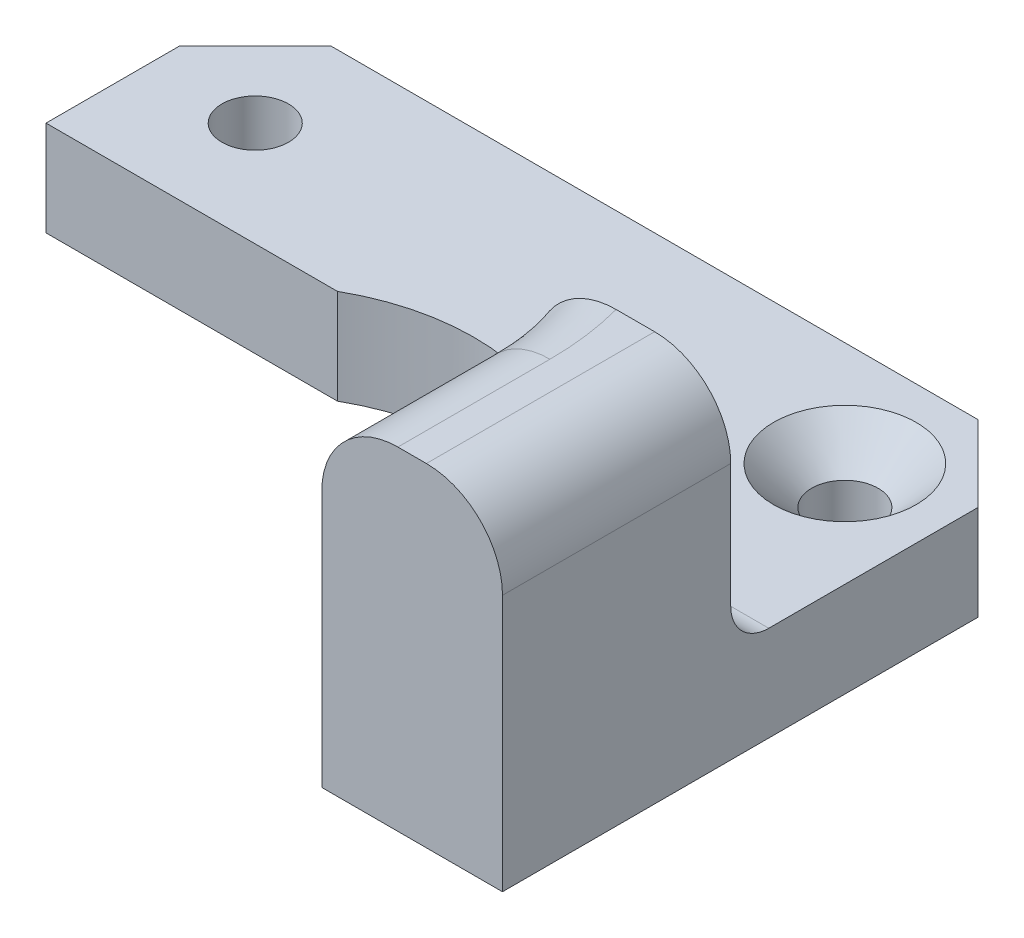
ISO-10303-21;
HEADER;
FILE_DESCRIPTION(('STEP AP214'),'2;1');
FILE_NAME('part.step','',(''),(''),'','','');
FILE_SCHEMA(('AUTOMOTIVE_DESIGN { 1 0 10303 214 1 1 1 1 }'));
ENDSEC;
DATA;
#1=APPLICATION_CONTEXT('core data for automotive mechanical design processes');
#2=APPLICATION_PROTOCOL_DEFINITION('international standard','automotive_design',2000,#1);
#3=PRODUCT_CONTEXT('',#1,'mechanical');
#4=PRODUCT('Part','Part','',(#3));
#5=PRODUCT_RELATED_PRODUCT_CATEGORY('part','',(#4));
#6=PRODUCT_DEFINITION_FORMATION('','',#4);
#7=PRODUCT_DEFINITION_CONTEXT('part definition',#1,'design');
#8=PRODUCT_DEFINITION('design','',#6,#7);
#9=PRODUCT_DEFINITION_SHAPE('','',#8);
#10=(LENGTH_UNIT() NAMED_UNIT(*) SI_UNIT(.MILLI.,.METRE.));
#11=(NAMED_UNIT(*) PLANE_ANGLE_UNIT() SI_UNIT($,.RADIAN.));
#12=(NAMED_UNIT(*) SI_UNIT($,.STERADIAN.) SOLID_ANGLE_UNIT());
#13=UNCERTAINTY_MEASURE_WITH_UNIT(LENGTH_MEASURE(1.E-05),#10,'distance_accuracy_value','');
#14=(GEOMETRIC_REPRESENTATION_CONTEXT(3) GLOBAL_UNCERTAINTY_ASSIGNED_CONTEXT((#13)) GLOBAL_UNIT_ASSIGNED_CONTEXT((#10,
#11,#12)) REPRESENTATION_CONTEXT('',''));
#15=CARTESIAN_POINT('',(0.,0.,0.));
#16=DIRECTION('',(0.,0.,1.));
#17=DIRECTION('',(1.,0.,0.));
#18=AXIS2_PLACEMENT_3D('',#15,#16,#17);
#19=CARTESIAN_POINT('',(10.7819293264239,17.5,-4.));
#20=DIRECTION('',(0.,0.,-1.));
#21=DIRECTION('',(-1.,0.,0.));
#22=AXIS2_PLACEMENT_3D('',#19,#20,#21);
#23=PLANE('',#22);
#24=CARTESIAN_POINT('',(16.25,12.,-4.));
#25=DIRECTION('',(0.,0.,-1.));
#26=DIRECTION('',(-1.,0.,0.));
#27=AXIS2_PLACEMENT_3D('',#24,#25,#26);
#28=CIRCLE('',#27,3.20020753820971);
#29=CARTESIAN_POINT('',(13.0497924617903,12.,-4.));
#30=VERTEX_POINT('',#29);
#31=EDGE_CURVE('E182',#30,#30,#28,.F.);
#32=ORIENTED_EDGE('',*,*,#31,.T.);
#33=EDGE_LOOP('',(#32));
#34=FACE_BOUND('',#33,.T.);
#35=DIRECTION('',(0.,-1.,0.));
#36=VECTOR('',#35,1.);
#37=CARTESIAN_POINT('',(10.7819293264239,17.5,-4.));
#38=LINE('',#37,#36);
#39=CARTESIAN_POINT('',(10.7819293264239,13.5,-4.));
#40=VERTEX_POINT('',#39);
#41=CARTESIAN_POINT('',(10.7819293264239,7.,-4.));
#42=VERTEX_POINT('',#41);
#43=EDGE_CURVE('E316',#40,#42,#38,.T.);
#44=ORIENTED_EDGE('',*,*,#43,.F.);
#45=CARTESIAN_POINT('',(10.7819293264239,13.5,-4.));
#46=CARTESIAN_POINT('',(10.7819113322001,13.6079339404412,-4.));
#47=CARTESIAN_POINT('',(10.7865881810567,13.7158624061115,-4.));
#48=CARTESIAN_POINT('',(10.8051986474926,13.9308957444516,-4.));
#49=CARTESIAN_POINT('',(10.8191302710947,14.0380007895032,-4.));
#50=CARTESIAN_POINT('',(10.8560670519765,14.250331960623,-4.));
#51=CARTESIAN_POINT('',(10.8790473665792,14.3555624133835,-4.));
#52=CARTESIAN_POINT('',(10.9338331924457,14.5636984620619,-4.));
#53=CARTESIAN_POINT('',(10.9656388991992,14.6666040064267,-4.));
#54=CARTESIAN_POINT('',(11.0377399526726,14.8693348759943,-4.));
#55=CARTESIAN_POINT('',(11.0780304962397,14.9691619074031,-4.));
#56=CARTESIAN_POINT('',(11.1667206212384,15.1651596091249,-4.));
#57=CARTESIAN_POINT('',(11.2151232123082,15.2613289060799,-4.));
#58=CARTESIAN_POINT('',(11.371876153395,15.5434309516824,-4.));
#59=CARTESIAN_POINT('',(11.491815464049,15.7230797859993,-4.));
#60=CARTESIAN_POINT('',(11.7626617220363,16.0663554230203,-4.));
#61=CARTESIAN_POINT('',(11.9144206280015,16.2293045326013,-4.));
#62=CARTESIAN_POINT('',(12.2418852189774,16.5291013137871,-4.));
#63=CARTESIAN_POINT('',(12.4175980823449,16.6659411315298,-4.));
#64=CARTESIAN_POINT('',(12.7984164920333,16.9173514752196,-4.));
#65=CARTESIAN_POINT('',(13.0046093962218,17.0302747100072,-4.));
#66=CARTESIAN_POINT('',(13.4325736651408,17.2211369838147,-4.));
#67=CARTESIAN_POINT('',(13.6543422205808,17.2990823129533,-4.));
#68=CARTESIAN_POINT('',(14.0593249592677,17.4054128790473,-4.));
#69=CARTESIAN_POINT('',(14.240733428527,17.44080526775,-4.));
#70=CARTESIAN_POINT('',(14.6063968340062,17.4881069503459,-4.));
#71=CARTESIAN_POINT('',(14.7906487151602,17.5000398902038,-4.));
#72=CARTESIAN_POINT('',(14.9749791318719,17.5,-4.));
#73=B_SPLINE_CURVE_WITH_KNOTS('',3,(#45,#46,#47,#48,#49,#50,#51,#52,#53,#54,#55,#56,#57,#58,#59,
#60,#61,#62,#63,#64,#65,#66,#67,#68,#69,#70,#71,#72),.UNSPECIFIED.,.F.,.F.,(4,2,2,2,2,2,2,2,2,2,
2,2,2,4),(0.,0.323692044420203,0.647314370743704,0.970054336464099,1.29280145170633,
1.61536635288569,1.93805119436675,2.58303687386118,3.24821541524213,3.91359373273049,
4.61571997699199,5.31771990640264,5.8707431844196,6.42320875593087),.UNSPECIFIED.);
#74=CARTESIAN_POINT('',(14.9749791318719,17.5,-4.));
#75=VERTEX_POINT('',#74);
#76=EDGE_CURVE('E237',#40,#75,#73,.T.);
#77=ORIENTED_EDGE('',*,*,#76,.T.);
#78=DIRECTION('',(1.,0.,0.));
#79=VECTOR('',#78,1.);
#80=CARTESIAN_POINT('',(10.7819293264239,17.5,-4.));
#81=LINE('',#80,#79);
#82=CARTESIAN_POINT('',(17.,17.5,-4.));
#83=VERTEX_POINT('',#82);
#84=EDGE_CURVE('E324',#75,#83,#81,.T.);
#85=ORIENTED_EDGE('',*,*,#84,.T.);
#86=CARTESIAN_POINT('',(17.,13.5,-4.));
#87=DIRECTION('',(0.,0.,-1.));
#88=DIRECTION('',(-1.,0.,0.));
#89=AXIS2_PLACEMENT_3D('',#86,#87,#88);
#90=CIRCLE('',#89,4.);
#91=CARTESIAN_POINT('',(21.,13.5,-4.));
#92=VERTEX_POINT('',#91);
#93=EDGE_CURVE('E245',#83,#92,#90,.T.);
#94=ORIENTED_EDGE('',*,*,#93,.T.);
#95=DIRECTION('',(0.,-1.,0.));
#96=VECTOR('',#95,1.);
#97=CARTESIAN_POINT('',(21.,17.5,-4.));
#98=LINE('',#97,#96);
#99=CARTESIAN_POINT('',(21.,7.,-4.));
#100=VERTEX_POINT('',#99);
#101=EDGE_CURVE('E311',#92,#100,#98,.T.);
#102=ORIENTED_EDGE('',*,*,#101,.T.);
#103=DIRECTION('',(-1.,0.,0.));
#104=VECTOR('',#103,1.);
#105=CARTESIAN_POINT('',(10.7819293264239,7.,-4.));
#106=LINE('',#105,#104);
#107=EDGE_CURVE('E205',#100,#42,#106,.T.);
#108=ORIENTED_EDGE('',*,*,#107,.T.);
#109=EDGE_LOOP('',(#44,#77,#85,#94,#102,#108));
#110=FACE_BOUND('',#109,.T.);
#111=ADVANCED_FACE('F32',(#34,#110),#23,.T.);
#112=CARTESIAN_POINT('',(0.,5.,0.));
#113=DIRECTION('',(0.,1.,0.));
#114=DIRECTION('',(0.,0.,1.));
#115=AXIS2_PLACEMENT_3D('',#112,#113,#114);
#116=PLANE('',#115);
#117=CARTESIAN_POINT('',(0.,5.,0.));
#118=DIRECTION('',(0.,-1.,0.));
#119=DIRECTION('',(0.,0.,1.));
#120=AXIS2_PLACEMENT_3D('',#117,#118,#119);
#121=CIRCLE('',#120,11.5);
#122=CARTESIAN_POINT('',(-5.67890834580027,5.,-10.));
#123=VERTEX_POINT('',#122);
#124=CARTESIAN_POINT('',(9.81070843517429,5.,-6.));
#125=VERTEX_POINT('',#124);
#126=EDGE_CURVE('E159',#123,#125,#121,.T.);
#127=ORIENTED_EDGE('',*,*,#126,.T.);
#128=DIRECTION('',(-1.,0.,0.));
#129=VECTOR('',#128,1.);
#130=CARTESIAN_POINT('',(21.,5.,-6.));
#131=LINE('',#130,#129);
#132=CARTESIAN_POINT('',(21.,5.,-6.));
#133=VERTEX_POINT('',#132);
#134=EDGE_CURVE('E208',#125,#133,#131,.F.);
#135=ORIENTED_EDGE('',*,*,#134,.T.);
#136=DIRECTION('',(0.,0.,-1.));
#137=VECTOR('',#136,1.);
#138=CARTESIAN_POINT('',(21.,5.,-21.));
#139=LINE('',#138,#137);
#140=CARTESIAN_POINT('',(21.,5.,-17.));
#141=VERTEX_POINT('',#140);
#142=EDGE_CURVE('E312',#133,#141,#139,.T.);
#143=ORIENTED_EDGE('',*,*,#142,.T.);
#144=DIRECTION('',(0.707106781186546,0.,0.707106781186549));
#145=VECTOR('',#144,1.);
#146=CARTESIAN_POINT('',(19.,5.,-19.));
#147=LINE('',#146,#145);
#148=CARTESIAN_POINT('',(17.,5.,-21.));
#149=VERTEX_POINT('',#148);
#150=EDGE_CURVE('E199',#141,#149,#147,.F.);
#151=ORIENTED_EDGE('',*,*,#150,.T.);
#152=DIRECTION('',(-1.,0.,0.));
#153=VECTOR('',#152,1.);
#154=CARTESIAN_POINT('',(-21.,5.,-21.));
#155=LINE('',#154,#153);
#156=CARTESIAN_POINT('',(-17.,5.,-21.));
#157=VERTEX_POINT('',#156);
#158=EDGE_CURVE('E336',#149,#157,#155,.T.);
#159=ORIENTED_EDGE('',*,*,#158,.T.);
#160=DIRECTION('',(0.707106781186549,0.,-0.707106781186546));
#161=VECTOR('',#160,1.);
#162=CARTESIAN_POINT('',(-19.,5.,-19.));
#163=LINE('',#162,#161);
#164=CARTESIAN_POINT('',(-21.,5.,-17.));
#165=VERTEX_POINT('',#164);
#166=EDGE_CURVE('E145',#157,#165,#163,.F.);
#167=ORIENTED_EDGE('',*,*,#166,.T.);
#168=DIRECTION('',(0.,0.,1.));
#169=VECTOR('',#168,1.);
#170=CARTESIAN_POINT('',(-21.,5.,-21.));
#171=LINE('',#170,#169);
#172=CARTESIAN_POINT('',(-21.,5.,-10.));
#173=VERTEX_POINT('',#172);
#174=EDGE_CURVE('E136',#165,#173,#171,.T.);
#175=ORIENTED_EDGE('',*,*,#174,.T.);
#176=DIRECTION('',(1.,0.,0.));
#177=VECTOR('',#176,1.);
#178=CARTESIAN_POINT('',(-21.,5.,-10.));
#179=LINE('',#178,#177);
#180=EDGE_CURVE('E141',#173,#123,#179,.T.);
#181=ORIENTED_EDGE('',*,*,#180,.T.);
#182=EDGE_LOOP('',(#127,#135,#143,#151,#159,#167,#175,#181));
#183=FACE_BOUND('',#182,.T.);
#184=CARTESIAN_POINT('',(15.5,5.,-15.5));
#185=DIRECTION('',(0.,1.,0.));
#186=DIRECTION('',(0.,0.,1.));
#187=AXIS2_PLACEMENT_3D('',#184,#185,#186);
#188=CIRCLE('',#187,3.75000000000001);
#189=CARTESIAN_POINT('',(15.5,5.,-11.75));
#190=VERTEX_POINT('',#189);
#191=EDGE_CURVE('E168',#190,#190,#188,.F.);
#192=ORIENTED_EDGE('',*,*,#191,.T.);
#193=EDGE_LOOP('',(#192));
#194=FACE_BOUND('',#193,.T.);
#195=CARTESIAN_POINT('',(-15.5,5.,-15.5));
#196=DIRECTION('',(0.,1.,0.));
#197=DIRECTION('',(0.,0.,1.));
#198=AXIS2_PLACEMENT_3D('',#195,#196,#197);
#199=CIRCLE('',#198,1.75);
#200=CARTESIAN_POINT('',(-15.5,5.,-13.75));
#201=VERTEX_POINT('',#200);
#202=EDGE_CURVE('E329',#201,#201,#199,.T.);
#203=ORIENTED_EDGE('',*,*,#202,.F.);
#204=EDGE_LOOP('',(#203));
#205=FACE_BOUND('',#204,.T.);
#206=ADVANCED_FACE('F139',(#183,#194,#205),#116,.T.);
#207=CARTESIAN_POINT('',(0.,0.,0.));
#208=DIRECTION('',(0.,1.,0.));
#209=DIRECTION('',(0.,0.,1.));
#210=AXIS2_PLACEMENT_3D('',#207,#208,#209);
#211=PLANE('',#210);
#212=CARTESIAN_POINT('',(-15.5,0.,-15.5));
#213=DIRECTION('',(0.,1.,0.));
#214=DIRECTION('',(0.,0.,1.));
#215=AXIS2_PLACEMENT_3D('',#212,#213,#214);
#216=CIRCLE('',#215,1.75);
#217=CARTESIAN_POINT('',(-15.5,0.,-13.75));
#218=VERTEX_POINT('',#217);
#219=EDGE_CURVE('E322',#218,#218,#216,.T.);
#220=ORIENTED_EDGE('',*,*,#219,.T.);
#221=EDGE_LOOP('',(#220));
#222=FACE_BOUND('',#221,.T.);
#223=DIRECTION('',(0.,0.,1.));
#224=VECTOR('',#223,1.);
#225=CARTESIAN_POINT('',(-21.,0.,-21.));
#226=LINE('',#225,#224);
#227=CARTESIAN_POINT('',(-21.,0.,-17.));
#228=VERTEX_POINT('',#227);
#229=CARTESIAN_POINT('',(-21.,0.,-10.));
#230=VERTEX_POINT('',#229);
#231=EDGE_CURVE('E163',#228,#230,#226,.T.);
#232=ORIENTED_EDGE('',*,*,#231,.F.);
#233=DIRECTION('',(-0.707106781186549,0.,0.707106781186546));
#234=VECTOR('',#233,1.);
#235=CARTESIAN_POINT('',(-21.,0.,-17.));
#236=LINE('',#235,#234);
#237=CARTESIAN_POINT('',(-17.,0.,-21.));
#238=VERTEX_POINT('',#237);
#239=EDGE_CURVE('E192',#228,#238,#236,.F.);
#240=ORIENTED_EDGE('',*,*,#239,.T.);
#241=DIRECTION('',(-1.,0.,0.));
#242=VECTOR('',#241,1.);
#243=CARTESIAN_POINT('',(-21.,0.,-21.));
#244=LINE('',#243,#242);
#245=CARTESIAN_POINT('',(17.,0.,-21.));
#246=VERTEX_POINT('',#245);
#247=EDGE_CURVE('E150',#246,#238,#244,.T.);
#248=ORIENTED_EDGE('',*,*,#247,.F.);
#249=DIRECTION('',(-0.707106781186546,0.,-0.707106781186549));
#250=VECTOR('',#249,1.);
#251=CARTESIAN_POINT('',(17.,0.,-21.));
#252=LINE('',#251,#250);
#253=CARTESIAN_POINT('',(21.,0.,-17.));
#254=VERTEX_POINT('',#253);
#255=EDGE_CURVE('E190',#246,#254,#252,.F.);
#256=ORIENTED_EDGE('',*,*,#255,.T.);
#257=DIRECTION('',(0.,0.,-1.));
#258=VECTOR('',#257,1.);
#259=CARTESIAN_POINT('',(21.,0.,-21.));
#260=LINE('',#259,#258);
#261=CARTESIAN_POINT('',(21.,0.,8.));
#262=VERTEX_POINT('',#261);
#263=EDGE_CURVE('E347',#262,#254,#260,.T.);
#264=ORIENTED_EDGE('',*,*,#263,.F.);
#265=DIRECTION('',(1.,0.,0.));
#266=VECTOR('',#265,1.);
#267=CARTESIAN_POINT('',(21.,0.,8.));
#268=LINE('',#267,#266);
#269=CARTESIAN_POINT('',(11.5,0.,8.));
#270=VERTEX_POINT('',#269);
#271=EDGE_CURVE('E345',#270,#262,#268,.T.);
#272=ORIENTED_EDGE('',*,*,#271,.F.);
#273=DIRECTION('',(0.,0.,1.));
#274=VECTOR('',#273,1.);
#275=CARTESIAN_POINT('',(11.5,0.,0.));
#276=LINE('',#275,#274);
#277=CARTESIAN_POINT('',(11.5,0.,0.));
#278=VERTEX_POINT('',#277);
#279=EDGE_CURVE('E291',#278,#270,#276,.T.);
#280=ORIENTED_EDGE('',*,*,#279,.F.);
#281=CARTESIAN_POINT('',(0.,0.,0.));
#282=DIRECTION('',(0.,-1.,0.));
#283=DIRECTION('',(0.,0.,1.));
#284=AXIS2_PLACEMENT_3D('',#281,#282,#283);
#285=CIRCLE('',#284,11.5);
#286=CARTESIAN_POINT('',(-5.67890834580027,0.,-10.));
#287=VERTEX_POINT('',#286);
#288=EDGE_CURVE('E341',#287,#278,#285,.T.);
#289=ORIENTED_EDGE('',*,*,#288,.F.);
#290=DIRECTION('',(1.,0.,0.));
#291=VECTOR('',#290,1.);
#292=CARTESIAN_POINT('',(-21.,0.,-10.));
#293=LINE('',#292,#291);
#294=EDGE_CURVE('E339',#230,#287,#293,.T.);
#295=ORIENTED_EDGE('',*,*,#294,.F.);
#296=EDGE_LOOP('',(#232,#240,#248,#256,#264,#272,#280,#289,#295));
#297=FACE_BOUND('',#296,.T.);
#298=CARTESIAN_POINT('',(15.5,0.,-15.5));
#299=DIRECTION('',(0.,1.,0.));
#300=DIRECTION('',(0.,0.,1.));
#301=AXIS2_PLACEMENT_3D('',#298,#299,#300);
#302=CIRCLE('',#301,1.75);
#303=CARTESIAN_POINT('',(15.5,0.,-13.75));
#304=VERTEX_POINT('',#303);
#305=EDGE_CURVE('E319',#304,#304,#302,.T.);
#306=ORIENTED_EDGE('',*,*,#305,.T.);
#307=EDGE_LOOP('',(#306));
#308=FACE_BOUND('',#307,.T.);
#309=ADVANCED_FACE('F266',(#222,#297,#308),#211,.F.);
#310=CARTESIAN_POINT('',(-21.,5.,-21.));
#311=DIRECTION('',(1.,0.,0.));
#312=DIRECTION('',(0.,0.,-1.));
#313=AXIS2_PLACEMENT_3D('',#310,#311,#312);
#314=PLANE('',#313);
#315=ORIENTED_EDGE('',*,*,#174,.F.);
#316=DIRECTION('',(0.,-1.,0.));
#317=VECTOR('',#316,1.);
#318=CARTESIAN_POINT('',(-21.,5.,-17.));
#319=LINE('',#318,#317);
#320=EDGE_CURVE('E188',#165,#228,#319,.T.);
#321=ORIENTED_EDGE('',*,*,#320,.T.);
#322=ORIENTED_EDGE('',*,*,#231,.T.);
#323=DIRECTION('',(0.,-1.,0.));
#324=VECTOR('',#323,1.);
#325=CARTESIAN_POINT('',(-21.,5.,-10.));
#326=LINE('',#325,#324);
#327=EDGE_CURVE('E155',#173,#230,#326,.T.);
#328=ORIENTED_EDGE('',*,*,#327,.F.);
#329=EDGE_LOOP('',(#315,#321,#322,#328));
#330=FACE_BOUND('',#329,.T.);
#331=ADVANCED_FACE('F161',(#330),#314,.F.);
#332=CARTESIAN_POINT('',(-21.,5.,-10.));
#333=DIRECTION('',(0.,0.,-1.));
#334=DIRECTION('',(-1.,0.,0.));
#335=AXIS2_PLACEMENT_3D('',#332,#333,#334);
#336=PLANE('',#335);
#337=ORIENTED_EDGE('',*,*,#294,.T.);
#338=DIRECTION('',(0.,-1.,0.));
#339=VECTOR('',#338,1.);
#340=CARTESIAN_POINT('',(-5.67890834580027,5.,-10.));
#341=LINE('',#340,#339);
#342=EDGE_CURVE('E157',#123,#287,#341,.T.);
#343=ORIENTED_EDGE('',*,*,#342,.F.);
#344=ORIENTED_EDGE('',*,*,#180,.F.);
#345=ORIENTED_EDGE('',*,*,#327,.T.);
#346=EDGE_LOOP('',(#337,#343,#344,#345));
#347=FACE_BOUND('',#346,.T.);
#348=ADVANCED_FACE('F154',(#347),#336,.F.);
#349=CARTESIAN_POINT('',(0.,5.,0.));
#350=DIRECTION('',(0.,-1.,0.));
#351=DIRECTION('',(0.,0.,-1.));
#352=AXIS2_PLACEMENT_3D('',#349,#350,#351);
#353=CYLINDRICAL_SURFACE('',#352,11.5);
#354=DIRECTION('',(0.,-1.,0.));
#355=VECTOR('',#354,1.);
#356=CARTESIAN_POINT('',(11.5,5.,0.));
#357=LINE('',#356,#355);
#358=CARTESIAN_POINT('',(11.5,13.5,0.));
#359=VERTEX_POINT('',#358);
#360=EDGE_CURVE('E170',#359,#278,#357,.T.);
#361=ORIENTED_EDGE('',*,*,#360,.F.);
#362=CARTESIAN_POINT('',(0.,13.5,0.));
#363=DIRECTION('',(0.,-1.,0.));
#364=DIRECTION('',(0.,0.,-1.));
#365=AXIS2_PLACEMENT_3D('',#362,#363,#364);
#366=CIRCLE('',#365,11.5);
#367=EDGE_CURVE('E304',#359,#40,#366,.F.);
#368=ORIENTED_EDGE('',*,*,#367,.T.);
#369=ORIENTED_EDGE('',*,*,#43,.T.);
#370=CARTESIAN_POINT('',(10.7819293264239,7.,-4.));
#371=CARTESIAN_POINT('',(10.781928896439,6.94668499201371,-3.99999306291747));
#372=CARTESIAN_POINT('',(10.7811383826113,6.89337298506699,-4.00213176570851));
#373=CARTESIAN_POINT('',(10.7779749678426,6.78714178671468,-4.01064749916559));
#374=CARTESIAN_POINT('',(10.7756022491027,6.73422255078837,-4.01702404181663));
#375=CARTESIAN_POINT('',(10.7692782187933,6.62925105981804,-4.03394643635994));
#376=CARTESIAN_POINT('',(10.7653299147071,6.57719734872023,-4.04448434462496));
#377=CARTESIAN_POINT('',(10.7558550196081,6.47423967786697,-4.06961443616462));
#378=CARTESIAN_POINT('',(10.7503284302574,6.42333571690085,-4.08420661516988));
#379=CARTESIAN_POINT('',(10.7313707258184,6.27286908410614,-4.13387914277233));
#380=CARTESIAN_POINT('',(10.7155570874057,6.17547414453434,-4.17486815194075));
#381=CARTESIAN_POINT('',(10.6776158087801,5.98933608259351,-4.27096830332735));
#382=CARTESIAN_POINT('',(10.6554873872621,5.90059403263915,-4.32608119295594));
#383=CARTESIAN_POINT('',(10.6046043306446,5.73249409016094,-4.44936756144325));
#384=CARTESIAN_POINT('',(10.5757479828505,5.65331187449284,-4.51773849270829));
#385=CARTESIAN_POINT('',(10.5118816715287,5.50772344847813,-4.6644113405625));
#386=CARTESIAN_POINT('',(10.4768718831538,5.44131687459546,-4.74271297446428));
#387=CARTESIAN_POINT('',(10.3990402406925,5.31900908359489,-4.91111089598183));
#388=CARTESIAN_POINT('',(10.3558960539167,5.26388015658177,-5.00161787502475));
#389=CARTESIAN_POINT('',(10.2638626547014,5.16932493124776,-5.18786448896512));
#390=CARTESIAN_POINT('',(10.2149658354169,5.12991973396497,-5.28361096067905));
#391=CARTESIAN_POINT('',(10.1094119900906,5.06498387342081,-5.48299018369092));
#392=CARTESIAN_POINT('',(10.0524748548707,5.04034487609617,-5.58676566264401));
#393=CARTESIAN_POINT('',(9.96393012393754,5.01598173277778,-5.74227043690106));
#394=CARTESIAN_POINT('',(9.93392629698682,5.00995964090088,-5.79402288031019));
#395=CARTESIAN_POINT('',(9.87298838219979,5.00197131708616,-5.89726151835817));
#396=CARTESIAN_POINT('',(9.84205473642644,5.00000318777839,-5.94874782629579));
#397=CARTESIAN_POINT('',(9.81070843517429,5.,-6.));
#398=B_SPLINE_CURVE_WITH_KNOTS('',3,(#370,#371,#372,#373,#374,#375,#376,#377,#378,#379,#380,
#381,#382,#383,#384,#385,#386,#387,#388,#389,#390,#391,#392,#393,#394,#395,#396,#397),
.UNSPECIFIED.,.F.,.F.,(4,2,2,2,2,2,2,2,2,2,2,2,2,4),(0.,0.159891025961582,0.319763642614334,
0.47933254245456,0.638901274261037,0.957805681703727,1.27674956315229,1.60086980445514,
1.92498082142079,2.26680160409969,2.6090795753478,2.97035868998385,3.15060747270293,
3.3307718746719),.UNSPECIFIED.);
#399=EDGE_CURVE('E210',#42,#125,#398,.T.);
#400=ORIENTED_EDGE('',*,*,#399,.T.);
#401=ORIENTED_EDGE('',*,*,#126,.F.);
#402=ORIENTED_EDGE('',*,*,#342,.T.);
#403=ORIENTED_EDGE('',*,*,#288,.T.);
#404=EDGE_LOOP('',(#361,#368,#369,#400,#401,#402,#403));
#405=FACE_BOUND('',#404,.T.);
#406=ADVANCED_FACE('F219',(#405),#353,.F.);
#407=CARTESIAN_POINT('',(11.5,5.,0.));
#408=DIRECTION('',(1.,0.,0.));
#409=DIRECTION('',(0.,0.,-1.));
#410=AXIS2_PLACEMENT_3D('',#407,#408,#409);
#411=PLANE('',#410);
#412=DIRECTION('',(0.,-1.,0.));
#413=VECTOR('',#412,1.);
#414=CARTESIAN_POINT('',(11.5,5.,8.));
#415=LINE('',#414,#413);
#416=CARTESIAN_POINT('',(11.5,13.5,8.));
#417=VERTEX_POINT('',#416);
#418=EDGE_CURVE('E287',#417,#270,#415,.T.);
#419=ORIENTED_EDGE('',*,*,#418,.F.);
#420=DIRECTION('',(0.,0.,-1.));
#421=VECTOR('',#420,1.);
#422=CARTESIAN_POINT('',(11.5,13.5,0.));
#423=LINE('',#422,#421);
#424=EDGE_CURVE('E11',#417,#359,#423,.T.);
#425=ORIENTED_EDGE('',*,*,#424,.T.);
#426=ORIENTED_EDGE('',*,*,#360,.T.);
#427=ORIENTED_EDGE('',*,*,#279,.T.);
#428=EDGE_LOOP('',(#419,#425,#426,#427));
#429=FACE_BOUND('',#428,.T.);
#430=ADVANCED_FACE('F279',(#429),#411,.F.);
#431=CARTESIAN_POINT('',(21.,5.,8.));
#432=DIRECTION('',(0.,0.,-1.));
#433=DIRECTION('',(-1.,0.,0.));
#434=AXIS2_PLACEMENT_3D('',#431,#432,#433);
#435=PLANE('',#434);
#436=DIRECTION('',(0.,-1.,0.));
#437=VECTOR('',#436,1.);
#438=CARTESIAN_POINT('',(21.,5.,8.));
#439=LINE('',#438,#437);
#440=CARTESIAN_POINT('',(21.,13.5,8.));
#441=VERTEX_POINT('',#440);
#442=EDGE_CURVE('E294',#441,#262,#439,.T.);
#443=ORIENTED_EDGE('',*,*,#442,.F.);
#444=CARTESIAN_POINT('',(17.,13.5,8.));
#445=DIRECTION('',(0.,0.,-1.));
#446=DIRECTION('',(-1.,0.,0.));
#447=AXIS2_PLACEMENT_3D('',#444,#445,#446);
#448=CIRCLE('',#447,4.);
#449=CARTESIAN_POINT('',(17.,17.5,8.));
#450=VERTEX_POINT('',#449);
#451=EDGE_CURVE('E41',#441,#450,#448,.F.);
#452=ORIENTED_EDGE('',*,*,#451,.T.);
#453=DIRECTION('',(-1.,0.,0.));
#454=VECTOR('',#453,1.);
#455=CARTESIAN_POINT('',(21.,17.5,8.));
#456=LINE('',#455,#454);
#457=CARTESIAN_POINT('',(15.5,17.5,8.));
#458=VERTEX_POINT('',#457);
#459=EDGE_CURVE('E302',#450,#458,#456,.T.);
#460=ORIENTED_EDGE('',*,*,#459,.T.);
#461=CARTESIAN_POINT('',(15.5,13.5,8.));
#462=DIRECTION('',(0.,0.,-1.));
#463=DIRECTION('',(-1.,0.,0.));
#464=AXIS2_PLACEMENT_3D('',#461,#462,#463);
#465=CIRCLE('',#464,4.);
#466=EDGE_CURVE('E48',#458,#417,#465,.F.);
#467=ORIENTED_EDGE('',*,*,#466,.T.);
#468=ORIENTED_EDGE('',*,*,#418,.T.);
#469=ORIENTED_EDGE('',*,*,#271,.T.);
#470=EDGE_LOOP('',(#443,#452,#460,#467,#468,#469));
#471=FACE_BOUND('',#470,.T.);
#472=ADVANCED_FACE('F276',(#471),#435,.F.);
#473=CARTESIAN_POINT('',(21.,5.,-21.));
#474=DIRECTION('',(-1.,0.,0.));
#475=DIRECTION('',(0.,0.,1.));
#476=AXIS2_PLACEMENT_3D('',#473,#474,#475);
#477=PLANE('',#476);
#478=ORIENTED_EDGE('',*,*,#101,.F.);
#479=DIRECTION('',(0.,0.,1.));
#480=VECTOR('',#479,1.);
#481=CARTESIAN_POINT('',(21.,13.5,-21.));
#482=LINE('',#481,#480);
#483=EDGE_CURVE('E359',#92,#441,#482,.T.);
#484=ORIENTED_EDGE('',*,*,#483,.T.);
#485=ORIENTED_EDGE('',*,*,#442,.T.);
#486=ORIENTED_EDGE('',*,*,#263,.T.);
#487=DIRECTION('',(0.,1.,0.));
#488=VECTOR('',#487,1.);
#489=CARTESIAN_POINT('',(21.,5.,-17.));
#490=LINE('',#489,#488);
#491=EDGE_CURVE('E202',#254,#141,#490,.T.);
#492=ORIENTED_EDGE('',*,*,#491,.T.);
#493=ORIENTED_EDGE('',*,*,#142,.F.);
#494=CARTESIAN_POINT('',(21.,7.,-6.));
#495=DIRECTION('',(-1.,0.,0.));
#496=DIRECTION('',(0.,0.,1.));
#497=AXIS2_PLACEMENT_3D('',#494,#495,#496);
#498=CIRCLE('',#497,2.);
#499=EDGE_CURVE('E217',#133,#100,#498,.T.);
#500=ORIENTED_EDGE('',*,*,#499,.T.);
#501=EDGE_LOOP('',(#478,#484,#485,#486,#492,#493,#500));
#502=FACE_BOUND('',#501,.T.);
#503=ADVANCED_FACE('F272',(#502),#477,.F.);
#504=CARTESIAN_POINT('',(-21.,5.,-21.));
#505=DIRECTION('',(0.,0.,1.));
#506=DIRECTION('',(1.,0.,0.));
#507=AXIS2_PLACEMENT_3D('',#504,#505,#506);
#508=PLANE('',#507);
#509=ORIENTED_EDGE('',*,*,#247,.T.);
#510=DIRECTION('',(0.,1.,0.));
#511=VECTOR('',#510,1.);
#512=CARTESIAN_POINT('',(-17.,5.,-21.));
#513=LINE('',#512,#511);
#514=EDGE_CURVE('E197',#238,#157,#513,.T.);
#515=ORIENTED_EDGE('',*,*,#514,.T.);
#516=ORIENTED_EDGE('',*,*,#158,.F.);
#517=DIRECTION('',(0.,-1.,0.));
#518=VECTOR('',#517,1.);
#519=CARTESIAN_POINT('',(17.,5.,-21.));
#520=LINE('',#519,#518);
#521=EDGE_CURVE('E194',#149,#246,#520,.T.);
#522=ORIENTED_EDGE('',*,*,#521,.T.);
#523=EDGE_LOOP('',(#509,#515,#516,#522));
#524=FACE_BOUND('',#523,.T.);
#525=ADVANCED_FACE('F262',(#524),#508,.F.);
#526=CARTESIAN_POINT('',(-15.5,5.,-15.5));
#527=DIRECTION('',(0.,-1.,0.));
#528=DIRECTION('',(0.,0.,-1.));
#529=AXIS2_PLACEMENT_3D('',#526,#527,#528);
#530=CYLINDRICAL_SURFACE('',#529,1.75);
#531=ORIENTED_EDGE('',*,*,#202,.T.);
#532=EDGE_LOOP('',(#531));
#533=FACE_BOUND('',#532,.T.);
#534=ORIENTED_EDGE('',*,*,#219,.F.);
#535=EDGE_LOOP('',(#534));
#536=FACE_BOUND('',#535,.T.);
#537=ADVANCED_FACE('F258',(#533,#536),#530,.F.);
#538=CARTESIAN_POINT('',(15.5,5.,-15.5));
#539=DIRECTION('',(0.,-1.,0.));
#540=DIRECTION('',(0.,0.,-1.));
#541=AXIS2_PLACEMENT_3D('',#538,#539,#540);
#542=CYLINDRICAL_SURFACE('',#541,1.75);
#543=CARTESIAN_POINT('',(15.5,2.99999999999999,-15.5));
#544=DIRECTION('',(0.,1.,0.));
#545=DIRECTION('',(0.,0.,1.));
#546=AXIS2_PLACEMENT_3D('',#543,#544,#545);
#547=CIRCLE('',#546,1.75);
#548=CARTESIAN_POINT('',(15.5,2.99999999999999,-13.75));
#549=VERTEX_POINT('',#548);
#550=EDGE_CURVE('E165',#549,#549,#547,.T.);
#551=ORIENTED_EDGE('',*,*,#550,.T.);
#552=EDGE_LOOP('',(#551));
#553=FACE_BOUND('',#552,.T.);
#554=ORIENTED_EDGE('',*,*,#305,.F.);
#555=EDGE_LOOP('',(#554));
#556=FACE_BOUND('',#555,.T.);
#557=ADVANCED_FACE('F254',(#553,#556),#542,.F.);
#558=CARTESIAN_POINT('',(15.5,2.99999999999999,-15.5));
#559=DIRECTION('',(0.,1.,0.));
#560=DIRECTION('',(0.,0.,1.));
#561=AXIS2_PLACEMENT_3D('',#558,#559,#560);
#562=CONICAL_SURFACE('',#561,1.75,0.785398163397448);
#563=ORIENTED_EDGE('',*,*,#191,.F.);
#564=EDGE_LOOP('',(#563));
#565=FACE_BOUND('',#564,.T.);
#566=ORIENTED_EDGE('',*,*,#550,.F.);
#567=EDGE_LOOP('',(#566));
#568=FACE_BOUND('',#567,.T.);
#569=ADVANCED_FACE('F257',(#565,#568),#562,.F.);
#570=CARTESIAN_POINT('',(0.,17.5,0.));
#571=DIRECTION('',(0.,-1.,0.));
#572=DIRECTION('',(0.,0.,-1.));
#573=AXIS2_PLACEMENT_3D('',#570,#571,#572);
#574=PLANE('',#573);
#575=ORIENTED_EDGE('',*,*,#459,.F.);
#576=DIRECTION('',(0.,0.,1.));
#577=VECTOR('',#576,1.);
#578=CARTESIAN_POINT('',(17.,17.5,0.));
#579=LINE('',#578,#577);
#580=EDGE_CURVE('E360',#450,#83,#579,.F.);
#581=ORIENTED_EDGE('',*,*,#580,.T.);
#582=ORIENTED_EDGE('',*,*,#84,.F.);
#583=CARTESIAN_POINT('',(0.,17.5,0.));
#584=DIRECTION('',(0.,-1.,0.));
#585=DIRECTION('',(0.,0.,-1.));
#586=AXIS2_PLACEMENT_3D('',#583,#584,#585);
#587=CIRCLE('',#586,15.5);
#588=CARTESIAN_POINT('',(15.5,17.5,0.));
#589=VERTEX_POINT('',#588);
#590=EDGE_CURVE('E363',#75,#589,#587,.T.);
#591=ORIENTED_EDGE('',*,*,#590,.T.);
#592=DIRECTION('',(0.,0.,-1.));
#593=VECTOR('',#592,1.);
#594=CARTESIAN_POINT('',(15.5,17.5,0.));
#595=LINE('',#594,#593);
#596=EDGE_CURVE('E244',#589,#458,#595,.F.);
#597=ORIENTED_EDGE('',*,*,#596,.T.);
#598=EDGE_LOOP('',(#575,#581,#582,#591,#597));
#599=FACE_BOUND('',#598,.T.);
#600=ADVANCED_FACE('F252',(#599),#574,.F.);
#601=CARTESIAN_POINT('',(16.25,12.,-4.));
#602=DIRECTION('',(0.,0.,1.));
#603=DIRECTION('',(-1.,0.,0.));
#604=AXIS2_PLACEMENT_3D('',#601,#602,#603);
#605=CONICAL_SURFACE('',#604,2.5,0.349065850398867);
#606=CARTESIAN_POINT('',(16.25,12.,-4.65797985667433));
#607=DIRECTION('',(0.,0.,-1.));
#608=DIRECTION('',(-1.,0.,0.));
#609=AXIS2_PLACEMENT_3D('',#606,#607,#608);
#610=CIRCLE('',#609,2.2605149174238);
#611=CARTESIAN_POINT('',(13.9894850825762,12.,-4.65797985667433));
#612=VERTEX_POINT('',#611);
#613=EDGE_CURVE('E179',#612,#612,#610,.T.);
#614=ORIENTED_EDGE('',*,*,#613,.T.);
#615=EDGE_LOOP('',(#614));
#616=FACE_BOUND('',#615,.T.);
#617=CARTESIAN_POINT('',(16.25,12.,-6.34202014332567));
#618=DIRECTION('',(0.,0.,1.));
#619=DIRECTION('',(1.,0.,0.));
#620=AXIS2_PLACEMENT_3D('',#617,#618,#619);
#621=CIRCLE('',#620,1.64757437977759);
#622=CARTESIAN_POINT('',(17.8975743797776,12.,-6.34202014332567));
#623=VERTEX_POINT('',#622);
#624=EDGE_CURVE('E176',#623,#623,#621,.T.);
#625=ORIENTED_EDGE('',*,*,#624,.T.);
#626=EDGE_LOOP('',(#625));
#627=FACE_BOUND('',#626,.T.);
#628=ADVANCED_FACE('F425',(#616,#627),#605,.T.);
#629=CARTESIAN_POINT('',(16.25,12.,-7.));
#630=DIRECTION('',(0.,0.,-1.));
#631=DIRECTION('',(-1.,0.,0.));
#632=AXIS2_PLACEMENT_3D('',#629,#630,#631);
#633=PLANE('',#632);
#634=CARTESIAN_POINT('',(16.25,12.,-7.));
#635=DIRECTION('',(0.,0.,-1.));
#636=DIRECTION('',(-1.,0.,0.));
#637=AXIS2_PLACEMENT_3D('',#634,#635,#636);
#638=CIRCLE('',#637,0.707881758991682);
#639=CARTESIAN_POINT('',(15.5421182410083,12.,-7.));
#640=VERTEX_POINT('',#639);
#641=EDGE_CURVE('E185',#640,#640,#638,.T.);
#642=ORIENTED_EDGE('',*,*,#641,.T.);
#643=EDGE_LOOP('',(#642));
#644=FACE_BOUND('',#643,.T.);
#645=ADVANCED_FACE('F417',(#644),#633,.T.);
#646=CARTESIAN_POINT('',(16.25,12.,-5.));
#647=DIRECTION('',(0.,0.,-1.));
#648=DIRECTION('',(-1.,0.,0.));
#649=AXIS2_PLACEMENT_3D('',#646,#647,#648);
#650=TOROIDAL_SURFACE('',#649,3.20020753820971,1.);
#651=ORIENTED_EDGE('',*,*,#31,.F.);
#652=EDGE_LOOP('',(#651));
#653=FACE_BOUND('',#652,.T.);
#654=ORIENTED_EDGE('',*,*,#613,.F.);
#655=EDGE_LOOP('',(#654));
#656=FACE_BOUND('',#655,.T.);
#657=ADVANCED_FACE('F408',(#653,#656),#650,.F.);
#658=CARTESIAN_POINT('',(16.25,12.,-6.));
#659=DIRECTION('',(0.,0.,-1.));
#660=DIRECTION('',(-1.,0.,0.));
#661=AXIS2_PLACEMENT_3D('',#658,#659,#660);
#662=DEGENERATE_TOROIDAL_SURFACE('',#661,0.707881758991682,1.,.T.);
#663=ORIENTED_EDGE('',*,*,#624,.F.);
#664=EDGE_LOOP('',(#663));
#665=FACE_BOUND('',#664,.T.);
#666=ORIENTED_EDGE('',*,*,#641,.F.);
#667=EDGE_LOOP('',(#666));
#668=FACE_BOUND('',#667,.T.);
#669=ADVANCED_FACE('F400',(#665,#668),#662,.T.);
#670=CARTESIAN_POINT('',(-21.,5.,-17.));
#671=DIRECTION('',(0.707106781186546,0.,0.707106781186549));
#672=DIRECTION('',(0.,-1.,0.));
#673=AXIS2_PLACEMENT_3D('',#670,#671,#672);
#674=PLANE('',#673);
#675=ORIENTED_EDGE('',*,*,#166,.F.);
#676=ORIENTED_EDGE('',*,*,#514,.F.);
#677=ORIENTED_EDGE('',*,*,#239,.F.);
#678=ORIENTED_EDGE('',*,*,#320,.F.);
#679=EDGE_LOOP('',(#675,#676,#677,#678));
#680=FACE_BOUND('',#679,.T.);
#681=ADVANCED_FACE('F393',(#680),#674,.F.);
#682=CARTESIAN_POINT('',(17.,5.,-21.));
#683=DIRECTION('',(-0.707106781186549,0.,0.707106781186546));
#684=DIRECTION('',(0.,-1.,0.));
#685=AXIS2_PLACEMENT_3D('',#682,#683,#684);
#686=PLANE('',#685);
#687=ORIENTED_EDGE('',*,*,#150,.F.);
#688=ORIENTED_EDGE('',*,*,#491,.F.);
#689=ORIENTED_EDGE('',*,*,#255,.F.);
#690=ORIENTED_EDGE('',*,*,#521,.F.);
#691=EDGE_LOOP('',(#687,#688,#689,#690));
#692=FACE_BOUND('',#691,.T.);
#693=ADVANCED_FACE('F229',(#692),#686,.F.);
#694=CARTESIAN_POINT('',(10.7819293264239,7.,-6.));
#695=DIRECTION('',(1.,0.,0.));
#696=DIRECTION('',(0.,0.,-1.));
#697=AXIS2_PLACEMENT_3D('',#694,#695,#696);
#698=CYLINDRICAL_SURFACE('',#697,2.);
#699=ORIENTED_EDGE('',*,*,#499,.F.);
#700=ORIENTED_EDGE('',*,*,#134,.F.);
#701=ORIENTED_EDGE('',*,*,#399,.F.);
#702=ORIENTED_EDGE('',*,*,#107,.F.);
#703=EDGE_LOOP('',(#699,#700,#701,#702));
#704=FACE_BOUND('',#703,.T.);
#705=ADVANCED_FACE('F223',(#704),#698,.F.);
#706=CARTESIAN_POINT('',(15.5,13.5,0.));
#707=DIRECTION('',(0.,0.,-1.));
#708=DIRECTION('',(-1.,0.,0.));
#709=AXIS2_PLACEMENT_3D('',#706,#707,#708);
#710=CYLINDRICAL_SURFACE('',#709,4.);
#711=ORIENTED_EDGE('',*,*,#466,.F.);
#712=ORIENTED_EDGE('',*,*,#596,.F.);
#713=CARTESIAN_POINT('',(15.5,13.5,0.));
#714=DIRECTION('',(0.,0.,-1.));
#715=DIRECTION('',(-1.,0.,0.));
#716=AXIS2_PLACEMENT_3D('',#713,#714,#715);
#717=CIRCLE('',#716,4.);
#718=EDGE_CURVE('E36',#359,#589,#717,.T.);
#719=ORIENTED_EDGE('',*,*,#718,.F.);
#720=ORIENTED_EDGE('',*,*,#424,.F.);
#721=EDGE_LOOP('',(#711,#712,#719,#720));
#722=FACE_BOUND('',#721,.T.);
#723=ADVANCED_FACE('F228',(#722),#710,.T.);
#724=CARTESIAN_POINT('',(0.,13.5,0.));
#725=DIRECTION('',(0.,-1.,0.));
#726=DIRECTION('',(0.,0.,-1.));
#727=AXIS2_PLACEMENT_3D('',#724,#725,#726);
#728=TOROIDAL_SURFACE('',#727,15.5,4.);
#729=ORIENTED_EDGE('',*,*,#718,.T.);
#730=ORIENTED_EDGE('',*,*,#590,.F.);
#731=ORIENTED_EDGE('',*,*,#76,.F.);
#732=ORIENTED_EDGE('',*,*,#367,.F.);
#733=EDGE_LOOP('',(#729,#730,#731,#732));
#734=FACE_BOUND('',#733,.T.);
#735=ADVANCED_FACE('F232',(#734),#728,.T.);
#736=CARTESIAN_POINT('',(17.,13.5,-21.));
#737=DIRECTION('',(0.,0.,1.));
#738=DIRECTION('',(1.,0.,0.));
#739=AXIS2_PLACEMENT_3D('',#736,#737,#738);
#740=CYLINDRICAL_SURFACE('',#739,4.);
#741=ORIENTED_EDGE('',*,*,#93,.F.);
#742=ORIENTED_EDGE('',*,*,#580,.F.);
#743=ORIENTED_EDGE('',*,*,#451,.F.);
#744=ORIENTED_EDGE('',*,*,#483,.F.);
#745=EDGE_LOOP('',(#741,#742,#743,#744));
#746=FACE_BOUND('',#745,.T.);
#747=ADVANCED_FACE('F34',(#746),#740,.T.);
#748=CLOSED_SHELL('',(#111,#206,#309,#331,#348,#406,#430,#472,#503,#525,#537,#557,#569,#600,
#628,#645,#657,#669,#681,#693,#705,#723,#735,#747));
#749=MANIFOLD_SOLID_BREP('B2',#748);
#750=ADVANCED_BREP_SHAPE_REPRESENTATION('',(#18,#749),#14);
#751=SHAPE_DEFINITION_REPRESENTATION(#9,#750);
ENDSEC;
END-ISO-10303-21;
